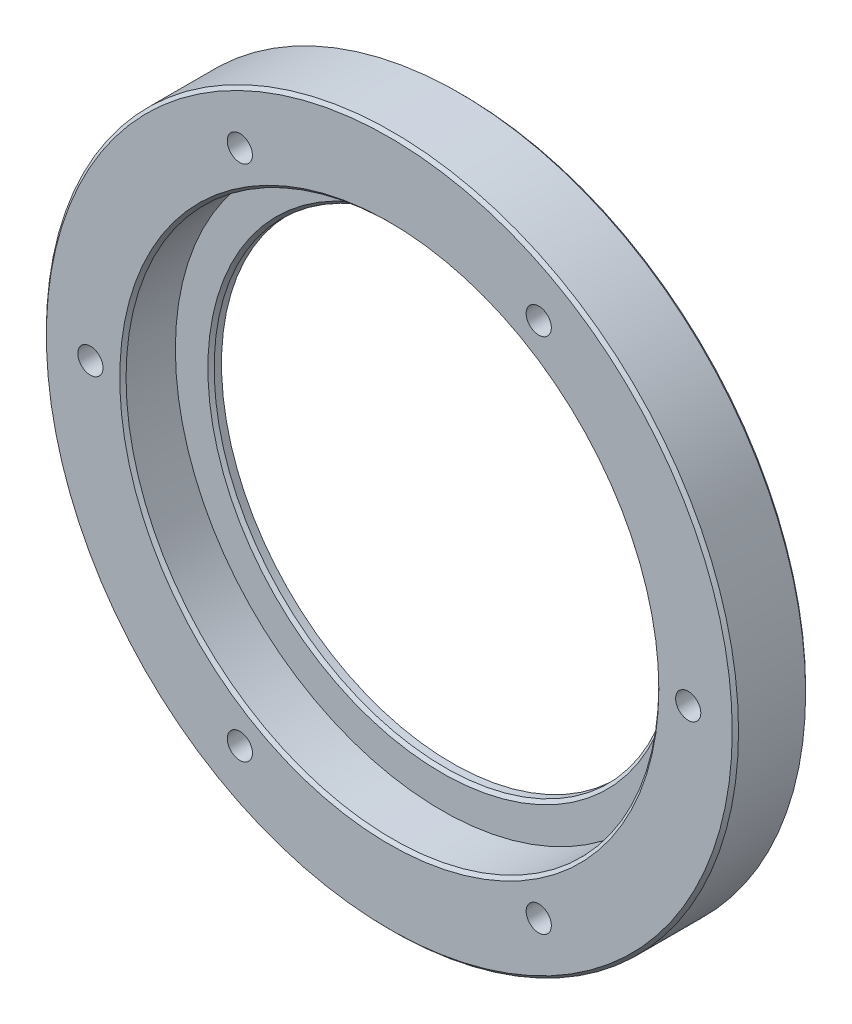
ISO-10303-21;
HEADER;
FILE_DESCRIPTION(('STEP AP214'),'2;1');
FILE_NAME('part.step','',(''),(''),'','','');
FILE_SCHEMA(('AUTOMOTIVE_DESIGN { 1 0 10303 214 1 1 1 1 }'));
ENDSEC;
DATA;
#1=APPLICATION_CONTEXT('core data for automotive mechanical design processes');
#2=APPLICATION_PROTOCOL_DEFINITION('international standard','automotive_design',2000,#1);
#3=PRODUCT_CONTEXT('',#1,'mechanical');
#4=PRODUCT('Part','Part','',(#3));
#5=PRODUCT_RELATED_PRODUCT_CATEGORY('part','',(#4));
#6=PRODUCT_DEFINITION_FORMATION('','',#4);
#7=PRODUCT_DEFINITION_CONTEXT('part definition',#1,'design');
#8=PRODUCT_DEFINITION('design','',#6,#7);
#9=PRODUCT_DEFINITION_SHAPE('','',#8);
#10=(LENGTH_UNIT() NAMED_UNIT(*) SI_UNIT(.MILLI.,.METRE.));
#11=(NAMED_UNIT(*) PLANE_ANGLE_UNIT() SI_UNIT($,.RADIAN.));
#12=(NAMED_UNIT(*) SI_UNIT($,.STERADIAN.) SOLID_ANGLE_UNIT());
#13=UNCERTAINTY_MEASURE_WITH_UNIT(LENGTH_MEASURE(1.E-05),#10,'distance_accuracy_value','');
#14=(GEOMETRIC_REPRESENTATION_CONTEXT(3) GLOBAL_UNCERTAINTY_ASSIGNED_CONTEXT((#13)) GLOBAL_UNIT_ASSIGNED_CONTEXT((#10,
#11,#12)) REPRESENTATION_CONTEXT('',''));
#15=CARTESIAN_POINT('',(0.,0.,0.));
#16=DIRECTION('',(0.,0.,1.));
#17=DIRECTION('',(1.,0.,0.));
#18=AXIS2_PLACEMENT_3D('',#15,#16,#17);
#19=CARTESIAN_POINT('',(-28.5,3.00107161343988E-13,7.));
#20=DIRECTION('',(0.,0.,-1.));
#21=DIRECTION('',(-1.,0.,0.));
#22=AXIS2_PLACEMENT_3D('',#19,#20,#21);
#23=CYLINDRICAL_SURFACE('',#22,1.2);
#24=CARTESIAN_POINT('',(-28.5,3.00107161343988E-13,7.));
#25=DIRECTION('',(0.,0.,-1.));
#26=DIRECTION('',(-0.50000000000001,-0.866025403784433,0.));
#27=AXIS2_PLACEMENT_3D('',#24,#25,#26);
#28=CIRCLE('',#27,1.2);
#29=CARTESIAN_POINT('',(-29.1,-1.03923048454102,7.));
#30=VERTEX_POINT('',#29);
#31=EDGE_CURVE('E93',#30,#30,#28,.T.);
#32=ORIENTED_EDGE('',*,*,#31,.F.);
#33=EDGE_LOOP('',(#32));
#34=FACE_BOUND('',#33,.T.);
#35=CARTESIAN_POINT('',(-28.5,3.00107161343988E-13,2.));
#36=DIRECTION('',(0.,0.,-1.));
#37=DIRECTION('',(-1.,0.,0.));
#38=AXIS2_PLACEMENT_3D('',#35,#36,#37);
#39=CIRCLE('',#38,1.2);
#40=CARTESIAN_POINT('',(-29.7,3.00107161343988E-13,2.));
#41=VERTEX_POINT('',#40);
#42=EDGE_CURVE('E89',#41,#41,#39,.F.);
#43=ORIENTED_EDGE('',*,*,#42,.F.);
#44=EDGE_LOOP('',(#43));
#45=FACE_BOUND('',#44,.T.);
#46=ADVANCED_FACE('F37',(#34,#45),#23,.F.);
#47=CARTESIAN_POINT('',(-14.2500000000002,-24.6817240078564,7.));
#48=DIRECTION('',(0.,0.,-1.));
#49=DIRECTION('',(-1.,0.,0.));
#50=AXIS2_PLACEMENT_3D('',#47,#48,#49);
#51=CYLINDRICAL_SURFACE('',#50,1.2);
#52=CARTESIAN_POINT('',(-14.2500000000002,-24.6817240078564,7.));
#53=DIRECTION('',(0.,0.,-1.));
#54=DIRECTION('',(0.499999999999992,-0.866025403784443,0.));
#55=AXIS2_PLACEMENT_3D('',#52,#53,#54);
#56=CIRCLE('',#55,1.2);
#57=CARTESIAN_POINT('',(-13.6500000000002,-25.7209544923977,7.));
#58=VERTEX_POINT('',#57);
#59=EDGE_CURVE('E134',#58,#58,#56,.T.);
#60=ORIENTED_EDGE('',*,*,#59,.F.);
#61=EDGE_LOOP('',(#60));
#62=FACE_BOUND('',#61,.T.);
#63=CARTESIAN_POINT('',(-14.2500000000002,-24.6817240078564,2.));
#64=DIRECTION('',(0.,0.,-1.));
#65=DIRECTION('',(-1.,0.,0.));
#66=AXIS2_PLACEMENT_3D('',#63,#64,#65);
#67=CIRCLE('',#66,1.2);
#68=CARTESIAN_POINT('',(-15.4500000000002,-24.6817240078564,2.));
#69=VERTEX_POINT('',#68);
#70=EDGE_CURVE('E94',#69,#69,#67,.F.);
#71=ORIENTED_EDGE('',*,*,#70,.F.);
#72=EDGE_LOOP('',(#71));
#73=FACE_BOUND('',#72,.T.);
#74=ADVANCED_FACE('F232',(#62,#73),#51,.F.);
#75=CARTESIAN_POINT('',(14.25,-24.6817240078565,7.));
#76=DIRECTION('',(0.,0.,-1.));
#77=DIRECTION('',(-1.,0.,0.));
#78=AXIS2_PLACEMENT_3D('',#75,#76,#77);
#79=CYLINDRICAL_SURFACE('',#78,1.2);
#80=CARTESIAN_POINT('',(14.25,-24.6817240078565,7.));
#81=DIRECTION('',(0.,0.,-1.));
#82=DIRECTION('',(1.,0.,0.));
#83=AXIS2_PLACEMENT_3D('',#80,#81,#82);
#84=CIRCLE('',#83,1.2);
#85=CARTESIAN_POINT('',(15.45,-24.6817240078565,7.));
#86=VERTEX_POINT('',#85);
#87=EDGE_CURVE('E138',#86,#86,#84,.T.);
#88=ORIENTED_EDGE('',*,*,#87,.F.);
#89=EDGE_LOOP('',(#88));
#90=FACE_BOUND('',#89,.T.);
#91=CARTESIAN_POINT('',(14.25,-24.6817240078565,2.));
#92=DIRECTION('',(0.,0.,-1.));
#93=DIRECTION('',(-1.,0.,0.));
#94=AXIS2_PLACEMENT_3D('',#91,#92,#93);
#95=CIRCLE('',#94,1.2);
#96=CARTESIAN_POINT('',(13.05,-24.6817240078565,2.));
#97=VERTEX_POINT('',#96);
#98=EDGE_CURVE('E98',#97,#97,#95,.F.);
#99=ORIENTED_EDGE('',*,*,#98,.F.);
#100=EDGE_LOOP('',(#99));
#101=FACE_BOUND('',#100,.T.);
#102=ADVANCED_FACE('F238',(#90,#101),#79,.F.);
#103=CARTESIAN_POINT('',(28.5,0.,7.));
#104=DIRECTION('',(0.,0.,-1.));
#105=DIRECTION('',(-1.,0.,0.));
#106=AXIS2_PLACEMENT_3D('',#103,#104,#105);
#107=CYLINDRICAL_SURFACE('',#106,1.2);
#108=CARTESIAN_POINT('',(28.5,0.,7.));
#109=DIRECTION('',(0.,0.,-1.));
#110=DIRECTION('',(0.500000000000004,0.866025403784436,0.));
#111=AXIS2_PLACEMENT_3D('',#108,#109,#110);
#112=CIRCLE('',#111,1.2);
#113=CARTESIAN_POINT('',(29.1,1.03923048454123,7.));
#114=VERTEX_POINT('',#113);
#115=EDGE_CURVE('E142',#114,#114,#112,.T.);
#116=ORIENTED_EDGE('',*,*,#115,.F.);
#117=EDGE_LOOP('',(#116));
#118=FACE_BOUND('',#117,.T.);
#119=CARTESIAN_POINT('',(28.5,0.,2.));
#120=DIRECTION('',(0.,0.,-1.));
#121=DIRECTION('',(-1.,0.,0.));
#122=AXIS2_PLACEMENT_3D('',#119,#120,#121);
#123=CIRCLE('',#122,1.2);
#124=CARTESIAN_POINT('',(27.3,0.,2.));
#125=VERTEX_POINT('',#124);
#126=EDGE_CURVE('E102',#125,#125,#123,.F.);
#127=ORIENTED_EDGE('',*,*,#126,.F.);
#128=EDGE_LOOP('',(#127));
#129=FACE_BOUND('',#128,.T.);
#130=ADVANCED_FACE('F246',(#118,#129),#107,.F.);
#131=CARTESIAN_POINT('',(14.25,24.6817240078565,7.));
#132=DIRECTION('',(0.,0.,-1.));
#133=DIRECTION('',(-1.,0.,0.));
#134=AXIS2_PLACEMENT_3D('',#131,#132,#133);
#135=CYLINDRICAL_SURFACE('',#134,1.2);
#136=CARTESIAN_POINT('',(14.25,24.6817240078565,7.));
#137=DIRECTION('',(0.,0.,-1.));
#138=DIRECTION('',(-0.499999999999998,0.86602540378444,0.));
#139=AXIS2_PLACEMENT_3D('',#136,#137,#138);
#140=CIRCLE('',#139,1.2);
#141=CARTESIAN_POINT('',(13.65,25.7209544923978,7.));
#142=VERTEX_POINT('',#141);
#143=EDGE_CURVE('E127',#142,#142,#140,.T.);
#144=ORIENTED_EDGE('',*,*,#143,.F.);
#145=EDGE_LOOP('',(#144));
#146=FACE_BOUND('',#145,.T.);
#147=CARTESIAN_POINT('',(14.25,24.6817240078565,2.));
#148=DIRECTION('',(0.,0.,-1.));
#149=DIRECTION('',(-1.,0.,0.));
#150=AXIS2_PLACEMENT_3D('',#147,#148,#149);
#151=CIRCLE('',#150,1.2);
#152=CARTESIAN_POINT('',(13.05,24.6817240078565,2.));
#153=VERTEX_POINT('',#152);
#154=EDGE_CURVE('E106',#153,#153,#151,.F.);
#155=ORIENTED_EDGE('',*,*,#154,.F.);
#156=EDGE_LOOP('',(#155));
#157=FACE_BOUND('',#156,.T.);
#158=ADVANCED_FACE('F250',(#146,#157),#135,.F.);
#159=CARTESIAN_POINT('',(-14.25,24.6817240078565,7.));
#160=DIRECTION('',(0.,0.,-1.));
#161=DIRECTION('',(-1.,0.,0.));
#162=AXIS2_PLACEMENT_3D('',#159,#160,#161);
#163=CYLINDRICAL_SURFACE('',#162,1.2);
#164=CARTESIAN_POINT('',(-14.25,24.6817240078565,7.));
#165=DIRECTION('',(0.,0.,-1.));
#166=DIRECTION('',(-1.,0.,0.));
#167=AXIS2_PLACEMENT_3D('',#164,#165,#166);
#168=CIRCLE('',#167,1.2);
#169=CARTESIAN_POINT('',(-15.45,24.6817240078565,7.));
#170=VERTEX_POINT('',#169);
#171=EDGE_CURVE('E115',#170,#170,#168,.T.);
#172=ORIENTED_EDGE('',*,*,#171,.F.);
#173=EDGE_LOOP('',(#172));
#174=FACE_BOUND('',#173,.T.);
#175=CARTESIAN_POINT('',(-14.25,24.6817240078565,2.));
#176=DIRECTION('',(0.,0.,-1.));
#177=DIRECTION('',(-1.,0.,0.));
#178=AXIS2_PLACEMENT_3D('',#175,#176,#177);
#179=CIRCLE('',#178,1.2);
#180=CARTESIAN_POINT('',(-15.45,24.6817240078565,2.));
#181=VERTEX_POINT('',#180);
#182=EDGE_CURVE('E111',#181,#181,#179,.F.);
#183=ORIENTED_EDGE('',*,*,#182,.F.);
#184=EDGE_LOOP('',(#183));
#185=FACE_BOUND('',#184,.T.);
#186=ADVANCED_FACE('F254',(#174,#185),#163,.F.);
#187=CARTESIAN_POINT('',(0.,0.,0.));
#188=DIRECTION('',(0.,0.,1.));
#189=DIRECTION('',(1.,0.,0.));
#190=AXIS2_PLACEMENT_3D('',#187,#188,#189);
#191=CYLINDRICAL_SURFACE('',#190,22.);
#192=CARTESIAN_POINT('',(0.,0.,1.70000000000001));
#193=DIRECTION('',(0.,0.,1.));
#194=DIRECTION('',(1.,0.,0.));
#195=AXIS2_PLACEMENT_3D('',#192,#193,#194);
#196=CIRCLE('',#195,22.);
#197=CARTESIAN_POINT('',(22.,0.,1.70000000000001));
#198=VERTEX_POINT('',#197);
#199=EDGE_CURVE('E72',#198,#198,#196,.T.);
#200=ORIENTED_EDGE('',*,*,#199,.T.);
#201=EDGE_LOOP('',(#200));
#202=FACE_BOUND('',#201,.T.);
#203=CARTESIAN_POINT('',(0.,0.,0.999999999999997));
#204=DIRECTION('',(0.,0.,1.));
#205=DIRECTION('',(1.,0.,0.));
#206=AXIS2_PLACEMENT_3D('',#203,#204,#205);
#207=CIRCLE('',#206,22.);
#208=CARTESIAN_POINT('',(22.,0.,0.999999999999997));
#209=VERTEX_POINT('',#208);
#210=EDGE_CURVE('E80',#209,#209,#207,.F.);
#211=ORIENTED_EDGE('',*,*,#210,.T.);
#212=EDGE_LOOP('',(#211));
#213=FACE_BOUND('',#212,.T.);
#214=ADVANCED_FACE('F426',(#202,#213),#191,.F.);
#215=CARTESIAN_POINT('',(0.,0.,7.));
#216=DIRECTION('',(0.,0.,-1.));
#217=DIRECTION('',(-1.,0.,0.));
#218=AXIS2_PLACEMENT_3D('',#215,#216,#217);
#219=CYLINDRICAL_SURFACE('',#218,33.);
#220=CARTESIAN_POINT('',(0.,0.,0.300000000000022));
#221=DIRECTION('',(0.,0.,1.));
#222=DIRECTION('',(1.,0.,0.));
#223=AXIS2_PLACEMENT_3D('',#220,#221,#222);
#224=CIRCLE('',#223,33.);
#225=CARTESIAN_POINT('',(33.,0.,0.300000000000022));
#226=VERTEX_POINT('',#225);
#227=EDGE_CURVE('E46',#226,#226,#224,.T.);
#228=ORIENTED_EDGE('',*,*,#227,.T.);
#229=EDGE_LOOP('',(#228));
#230=FACE_BOUND('',#229,.T.);
#231=CARTESIAN_POINT('',(0.,0.,6.69999999999999));
#232=DIRECTION('',(0.,0.,1.));
#233=DIRECTION('',(1.,0.,0.));
#234=AXIS2_PLACEMENT_3D('',#231,#232,#233);
#235=CIRCLE('',#234,33.);
#236=CARTESIAN_POINT('',(33.,0.,6.69999999999999));
#237=VERTEX_POINT('',#236);
#238=EDGE_CURVE('E52',#237,#237,#235,.F.);
#239=ORIENTED_EDGE('',*,*,#238,.T.);
#240=EDGE_LOOP('',(#239));
#241=FACE_BOUND('',#240,.T.);
#242=ADVANCED_FACE('F415',(#230,#241),#219,.T.);
#243=CARTESIAN_POINT('',(0.,0.,7.));
#244=DIRECTION('',(0.,0.,1.));
#245=DIRECTION('',(1.,0.,0.));
#246=AXIS2_PLACEMENT_3D('',#243,#244,#245);
#247=PLANE('',#246);
#248=CARTESIAN_POINT('',(0.,0.,7.));
#249=DIRECTION('',(0.,0.,1.));
#250=DIRECTION('',(1.,0.,0.));
#251=AXIS2_PLACEMENT_3D('',#248,#249,#250);
#252=CIRCLE('',#251,25.7);
#253=CARTESIAN_POINT('',(25.7,0.,7.));
#254=VERTEX_POINT('',#253);
#255=EDGE_CURVE('E58',#254,#254,#252,.F.);
#256=ORIENTED_EDGE('',*,*,#255,.T.);
#257=EDGE_LOOP('',(#256));
#258=FACE_BOUND('',#257,.T.);
#259=CARTESIAN_POINT('',(0.,0.,7.));
#260=DIRECTION('',(0.,0.,1.));
#261=DIRECTION('',(1.,0.,0.));
#262=AXIS2_PLACEMENT_3D('',#259,#260,#261);
#263=CIRCLE('',#262,32.7);
#264=CARTESIAN_POINT('',(32.7,0.,7.));
#265=VERTEX_POINT('',#264);
#266=EDGE_CURVE('E64',#265,#265,#263,.T.);
#267=ORIENTED_EDGE('',*,*,#266,.T.);
#268=EDGE_LOOP('',(#267));
#269=FACE_BOUND('',#268,.T.);
#270=ORIENTED_EDGE('',*,*,#143,.T.);
#271=EDGE_LOOP('',(#270));
#272=FACE_BOUND('',#271,.T.);
#273=ORIENTED_EDGE('',*,*,#115,.T.);
#274=EDGE_LOOP('',(#273));
#275=FACE_BOUND('',#274,.T.);
#276=ORIENTED_EDGE('',*,*,#87,.T.);
#277=EDGE_LOOP('',(#276));
#278=FACE_BOUND('',#277,.T.);
#279=ORIENTED_EDGE('',*,*,#59,.T.);
#280=EDGE_LOOP('',(#279));
#281=FACE_BOUND('',#280,.T.);
#282=ORIENTED_EDGE('',*,*,#31,.T.);
#283=EDGE_LOOP('',(#282));
#284=FACE_BOUND('',#283,.T.);
#285=ORIENTED_EDGE('',*,*,#171,.T.);
#286=EDGE_LOOP('',(#285));
#287=FACE_BOUND('',#286,.T.);
#288=ADVANCED_FACE('F204',(#258,#269,#272,#275,#278,#281,#284,#287),#247,.T.);
#289=CARTESIAN_POINT('',(0.,0.,0.));
#290=DIRECTION('',(0.,0.,1.));
#291=DIRECTION('',(1.,0.,0.));
#292=AXIS2_PLACEMENT_3D('',#289,#290,#291);
#293=PLANE('',#292);
#294=CARTESIAN_POINT('',(0.,0.,0.));
#295=DIRECTION('',(0.,0.,1.));
#296=DIRECTION('',(1.,0.,0.));
#297=AXIS2_PLACEMENT_3D('',#294,#295,#296);
#298=CIRCLE('',#297,32.7);
#299=CARTESIAN_POINT('',(32.7,0.,0.));
#300=VERTEX_POINT('',#299);
#301=EDGE_CURVE('E10',#300,#300,#298,.F.);
#302=ORIENTED_EDGE('',*,*,#301,.T.);
#303=EDGE_LOOP('',(#302));
#304=FACE_BOUND('',#303,.T.);
#305=CARTESIAN_POINT('',(0.,0.,0.));
#306=DIRECTION('',(0.,0.,1.));
#307=DIRECTION('',(1.,0.,0.));
#308=AXIS2_PLACEMENT_3D('',#305,#306,#307);
#309=CIRCLE('',#308,24.);
#310=CARTESIAN_POINT('',(24.,0.,0.));
#311=VERTEX_POINT('',#310);
#312=EDGE_CURVE('E84',#311,#311,#309,.T.);
#313=ORIENTED_EDGE('',*,*,#312,.T.);
#314=EDGE_LOOP('',(#313));
#315=FACE_BOUND('',#314,.T.);
#316=CARTESIAN_POINT('',(14.25,24.6817240078565,0.));
#317=DIRECTION('',(0.,0.,-1.));
#318=DIRECTION('',(-0.499999999999998,0.86602540378444,0.));
#319=AXIS2_PLACEMENT_3D('',#316,#317,#318);
#320=CIRCLE('',#319,2.1);
#321=CARTESIAN_POINT('',(13.2,26.5003773558038,0.));
#322=VERTEX_POINT('',#321);
#323=EDGE_CURVE('E181',#322,#322,#320,.T.);
#324=ORIENTED_EDGE('',*,*,#323,.F.);
#325=EDGE_LOOP('',(#324));
#326=FACE_BOUND('',#325,.T.);
#327=CARTESIAN_POINT('',(28.5,0.,0.));
#328=DIRECTION('',(0.,0.,-1.));
#329=DIRECTION('',(0.500000000000004,0.866025403784436,0.));
#330=AXIS2_PLACEMENT_3D('',#327,#328,#329);
#331=CIRCLE('',#330,2.1);
#332=CARTESIAN_POINT('',(29.55,1.81865334794722,0.));
#333=VERTEX_POINT('',#332);
#334=EDGE_CURVE('E173',#333,#333,#331,.T.);
#335=ORIENTED_EDGE('',*,*,#334,.F.);
#336=EDGE_LOOP('',(#335));
#337=FACE_BOUND('',#336,.T.);
#338=CARTESIAN_POINT('',(14.25,-24.6817240078565,0.));
#339=DIRECTION('',(0.,0.,-1.));
#340=DIRECTION('',(1.,0.,0.));
#341=AXIS2_PLACEMENT_3D('',#338,#339,#340);
#342=CIRCLE('',#341,2.1);
#343=CARTESIAN_POINT('',(16.35,-24.6817240078565,0.));
#344=VERTEX_POINT('',#343);
#345=EDGE_CURVE('E165',#344,#344,#342,.T.);
#346=ORIENTED_EDGE('',*,*,#345,.F.);
#347=EDGE_LOOP('',(#346));
#348=FACE_BOUND('',#347,.T.);
#349=CARTESIAN_POINT('',(-14.2500000000002,-24.6817240078564,0.));
#350=DIRECTION('',(0.,0.,-1.));
#351=DIRECTION('',(0.499999999999992,-0.866025403784443,0.));
#352=AXIS2_PLACEMENT_3D('',#349,#350,#351);
#353=CIRCLE('',#352,2.1);
#354=CARTESIAN_POINT('',(-13.2000000000002,-26.5003773558037,0.));
#355=VERTEX_POINT('',#354);
#356=EDGE_CURVE('E157',#355,#355,#353,.T.);
#357=ORIENTED_EDGE('',*,*,#356,.F.);
#358=EDGE_LOOP('',(#357));
#359=FACE_BOUND('',#358,.T.);
#360=CARTESIAN_POINT('',(-28.5,3.00107161343988E-13,0.));
#361=DIRECTION('',(0.,0.,-1.));
#362=DIRECTION('',(-0.50000000000001,-0.866025403784433,0.));
#363=AXIS2_PLACEMENT_3D('',#360,#361,#362);
#364=CIRCLE('',#363,2.1);
#365=CARTESIAN_POINT('',(-29.55,-1.81865334794701,0.));
#366=VERTEX_POINT('',#365);
#367=EDGE_CURVE('E149',#366,#366,#364,.T.);
#368=ORIENTED_EDGE('',*,*,#367,.F.);
#369=EDGE_LOOP('',(#368));
#370=FACE_BOUND('',#369,.T.);
#371=CARTESIAN_POINT('',(-14.25,24.6817240078565,0.));
#372=DIRECTION('',(0.,0.,-1.));
#373=DIRECTION('',(-1.,0.,0.));
#374=AXIS2_PLACEMENT_3D('',#371,#372,#373);
#375=CIRCLE('',#374,2.1);
#376=CARTESIAN_POINT('',(-16.35,24.6817240078565,0.));
#377=VERTEX_POINT('',#376);
#378=EDGE_CURVE('E123',#377,#377,#375,.T.);
#379=ORIENTED_EDGE('',*,*,#378,.F.);
#380=EDGE_LOOP('',(#379));
#381=FACE_BOUND('',#380,.T.);
#382=ADVANCED_FACE('F200',(#304,#315,#326,#337,#348,#359,#370,#381),#293,.F.);
#383=CARTESIAN_POINT('',(0.,0.,2.));
#384=DIRECTION('',(0.,0.,1.));
#385=DIRECTION('',(1.,0.,0.));
#386=AXIS2_PLACEMENT_3D('',#383,#384,#385);
#387=PLANE('',#386);
#388=CARTESIAN_POINT('',(0.,0.,2.));
#389=DIRECTION('',(0.,0.,1.));
#390=DIRECTION('',(1.,0.,0.));
#391=AXIS2_PLACEMENT_3D('',#388,#389,#390);
#392=CIRCLE('',#391,22.3);
#393=CARTESIAN_POINT('',(22.3,0.,2.));
#394=VERTEX_POINT('',#393);
#395=EDGE_CURVE('E76',#394,#394,#392,.F.);
#396=ORIENTED_EDGE('',*,*,#395,.T.);
#397=EDGE_LOOP('',(#396));
#398=FACE_BOUND('',#397,.T.);
#399=CARTESIAN_POINT('',(0.,0.,2.));
#400=DIRECTION('',(0.,0.,1.));
#401=DIRECTION('',(1.,0.,0.));
#402=AXIS2_PLACEMENT_3D('',#399,#400,#401);
#403=CIRCLE('',#402,25.4);
#404=CARTESIAN_POINT('',(25.4,0.,2.));
#405=VERTEX_POINT('',#404);
#406=EDGE_CURVE('E88',#405,#405,#403,.T.);
#407=ORIENTED_EDGE('',*,*,#406,.T.);
#408=EDGE_LOOP('',(#407));
#409=FACE_BOUND('',#408,.T.);
#410=ADVANCED_FACE('F203',(#398,#409),#387,.T.);
#411=CARTESIAN_POINT('',(0.,0.,2.));
#412=DIRECTION('',(0.,0.,1.));
#413=DIRECTION('',(1.,0.,0.));
#414=AXIS2_PLACEMENT_3D('',#411,#412,#413);
#415=CYLINDRICAL_SURFACE('',#414,25.4);
#416=CARTESIAN_POINT('',(0.,0.,6.69999999999998));
#417=DIRECTION('',(0.,0.,1.));
#418=DIRECTION('',(1.,0.,0.));
#419=AXIS2_PLACEMENT_3D('',#416,#417,#418);
#420=CIRCLE('',#419,25.4);
#421=CARTESIAN_POINT('',(25.4,0.,6.69999999999998));
#422=VERTEX_POINT('',#421);
#423=EDGE_CURVE('E68',#422,#422,#420,.T.);
#424=ORIENTED_EDGE('',*,*,#423,.T.);
#425=EDGE_LOOP('',(#424));
#426=FACE_BOUND('',#425,.T.);
#427=ORIENTED_EDGE('',*,*,#406,.F.);
#428=EDGE_LOOP('',(#427));
#429=FACE_BOUND('',#428,.T.);
#430=ADVANCED_FACE('F226',(#426,#429),#415,.F.);
#431=CARTESIAN_POINT('',(-14.25,24.6817240078565,2.));
#432=DIRECTION('',(0.,0.,-1.));
#433=DIRECTION('',(-1.,0.,0.));
#434=AXIS2_PLACEMENT_3D('',#431,#432,#433);
#435=PLANE('',#434);
#436=CARTESIAN_POINT('',(-14.25,24.6817240078565,2.));
#437=DIRECTION('',(0.,0.,-1.));
#438=DIRECTION('',(-1.,0.,0.));
#439=AXIS2_PLACEMENT_3D('',#436,#437,#438);
#440=CIRCLE('',#439,2.1);
#441=CARTESIAN_POINT('',(-16.35,24.6817240078565,2.));
#442=VERTEX_POINT('',#441);
#443=EDGE_CURVE('E116',#442,#442,#440,.T.);
#444=ORIENTED_EDGE('',*,*,#443,.T.);
#445=EDGE_LOOP('',(#444));
#446=FACE_BOUND('',#445,.T.);
#447=ORIENTED_EDGE('',*,*,#182,.T.);
#448=EDGE_LOOP('',(#447));
#449=FACE_BOUND('',#448,.T.);
#450=ADVANCED_FACE('F218',(#446,#449),#435,.T.);
#451=CARTESIAN_POINT('',(-14.25,24.6817240078565,2.));
#452=DIRECTION('',(0.,0.,-1.));
#453=DIRECTION('',(-1.,0.,0.));
#454=AXIS2_PLACEMENT_3D('',#451,#452,#453);
#455=CYLINDRICAL_SURFACE('',#454,2.1);
#456=ORIENTED_EDGE('',*,*,#443,.F.);
#457=EDGE_LOOP('',(#456));
#458=FACE_BOUND('',#457,.T.);
#459=ORIENTED_EDGE('',*,*,#378,.T.);
#460=EDGE_LOOP('',(#459));
#461=FACE_BOUND('',#460,.T.);
#462=ADVANCED_FACE('F216',(#458,#461),#455,.F.);
#463=CARTESIAN_POINT('',(14.25,24.6817240078565,2.));
#464=DIRECTION('',(0.,0.,-1.));
#465=DIRECTION('',(-0.499999999999998,0.86602540378444,0.));
#466=AXIS2_PLACEMENT_3D('',#463,#464,#465);
#467=PLANE('',#466);
#468=CARTESIAN_POINT('',(14.25,24.6817240078565,2.));
#469=DIRECTION('',(0.,0.,-1.));
#470=DIRECTION('',(-0.499999999999998,0.86602540378444,0.));
#471=AXIS2_PLACEMENT_3D('',#468,#469,#470);
#472=CIRCLE('',#471,2.1);
#473=CARTESIAN_POINT('',(13.2,26.5003773558038,2.));
#474=VERTEX_POINT('',#473);
#475=EDGE_CURVE('E110',#474,#474,#472,.T.);
#476=ORIENTED_EDGE('',*,*,#475,.T.);
#477=EDGE_LOOP('',(#476));
#478=FACE_BOUND('',#477,.T.);
#479=ORIENTED_EDGE('',*,*,#154,.T.);
#480=EDGE_LOOP('',(#479));
#481=FACE_BOUND('',#480,.T.);
#482=ADVANCED_FACE('F190',(#478,#481),#467,.T.);
#483=CARTESIAN_POINT('',(14.25,24.6817240078565,2.));
#484=DIRECTION('',(0.,0.,-1.));
#485=DIRECTION('',(-1.,0.,0.));
#486=AXIS2_PLACEMENT_3D('',#483,#484,#485);
#487=CYLINDRICAL_SURFACE('',#486,2.1);
#488=ORIENTED_EDGE('',*,*,#475,.F.);
#489=EDGE_LOOP('',(#488));
#490=FACE_BOUND('',#489,.T.);
#491=ORIENTED_EDGE('',*,*,#323,.T.);
#492=EDGE_LOOP('',(#491));
#493=FACE_BOUND('',#492,.T.);
#494=ADVANCED_FACE('F193',(#490,#493),#487,.F.);
#495=CARTESIAN_POINT('',(28.5,0.,2.));
#496=DIRECTION('',(0.,0.,-1.));
#497=DIRECTION('',(0.500000000000004,0.866025403784436,0.));
#498=AXIS2_PLACEMENT_3D('',#495,#496,#497);
#499=PLANE('',#498);
#500=CARTESIAN_POINT('',(28.5,0.,2.));
#501=DIRECTION('',(0.,0.,-1.));
#502=DIRECTION('',(0.500000000000004,0.866025403784436,0.));
#503=AXIS2_PLACEMENT_3D('',#500,#501,#502);
#504=CIRCLE('',#503,2.1);
#505=CARTESIAN_POINT('',(29.55,1.81865334794722,2.));
#506=VERTEX_POINT('',#505);
#507=EDGE_CURVE('E177',#506,#506,#504,.T.);
#508=ORIENTED_EDGE('',*,*,#507,.T.);
#509=EDGE_LOOP('',(#508));
#510=FACE_BOUND('',#509,.T.);
#511=ORIENTED_EDGE('',*,*,#126,.T.);
#512=EDGE_LOOP('',(#511));
#513=FACE_BOUND('',#512,.T.);
#514=ADVANCED_FACE('F196',(#510,#513),#499,.T.);
#515=CARTESIAN_POINT('',(28.5,0.,2.));
#516=DIRECTION('',(0.,0.,-1.));
#517=DIRECTION('',(-1.,0.,0.));
#518=AXIS2_PLACEMENT_3D('',#515,#516,#517);
#519=CYLINDRICAL_SURFACE('',#518,2.1);
#520=ORIENTED_EDGE('',*,*,#507,.F.);
#521=EDGE_LOOP('',(#520));
#522=FACE_BOUND('',#521,.T.);
#523=ORIENTED_EDGE('',*,*,#334,.T.);
#524=EDGE_LOOP('',(#523));
#525=FACE_BOUND('',#524,.T.);
#526=ADVANCED_FACE('F280',(#522,#525),#519,.F.);
#527=CARTESIAN_POINT('',(14.25,-24.6817240078565,2.));
#528=DIRECTION('',(0.,0.,-1.));
#529=DIRECTION('',(1.,0.,0.));
#530=AXIS2_PLACEMENT_3D('',#527,#528,#529);
#531=PLANE('',#530);
#532=CARTESIAN_POINT('',(14.25,-24.6817240078565,2.));
#533=DIRECTION('',(0.,0.,-1.));
#534=DIRECTION('',(1.,0.,0.));
#535=AXIS2_PLACEMENT_3D('',#532,#533,#534);
#536=CIRCLE('',#535,2.1);
#537=CARTESIAN_POINT('',(16.35,-24.6817240078565,2.));
#538=VERTEX_POINT('',#537);
#539=EDGE_CURVE('E169',#538,#538,#536,.T.);
#540=ORIENTED_EDGE('',*,*,#539,.T.);
#541=EDGE_LOOP('',(#540));
#542=FACE_BOUND('',#541,.T.);
#543=ORIENTED_EDGE('',*,*,#98,.T.);
#544=EDGE_LOOP('',(#543));
#545=FACE_BOUND('',#544,.T.);
#546=ADVANCED_FACE('F276',(#542,#545),#531,.T.);
#547=CARTESIAN_POINT('',(14.25,-24.6817240078565,2.));
#548=DIRECTION('',(0.,0.,-1.));
#549=DIRECTION('',(-1.,0.,0.));
#550=AXIS2_PLACEMENT_3D('',#547,#548,#549);
#551=CYLINDRICAL_SURFACE('',#550,2.1);
#552=ORIENTED_EDGE('',*,*,#539,.F.);
#553=EDGE_LOOP('',(#552));
#554=FACE_BOUND('',#553,.T.);
#555=ORIENTED_EDGE('',*,*,#345,.T.);
#556=EDGE_LOOP('',(#555));
#557=FACE_BOUND('',#556,.T.);
#558=ADVANCED_FACE('F272',(#554,#557),#551,.F.);
#559=CARTESIAN_POINT('',(-14.2500000000002,-24.6817240078564,2.));
#560=DIRECTION('',(0.,0.,-1.));
#561=DIRECTION('',(0.499999999999992,-0.866025403784443,0.));
#562=AXIS2_PLACEMENT_3D('',#559,#560,#561);
#563=PLANE('',#562);
#564=CARTESIAN_POINT('',(-14.2500000000002,-24.6817240078564,2.));
#565=DIRECTION('',(0.,0.,-1.));
#566=DIRECTION('',(0.499999999999992,-0.866025403784443,0.));
#567=AXIS2_PLACEMENT_3D('',#564,#565,#566);
#568=CIRCLE('',#567,2.1);
#569=CARTESIAN_POINT('',(-13.2000000000002,-26.5003773558037,2.));
#570=VERTEX_POINT('',#569);
#571=EDGE_CURVE('E161',#570,#570,#568,.T.);
#572=ORIENTED_EDGE('',*,*,#571,.T.);
#573=EDGE_LOOP('',(#572));
#574=FACE_BOUND('',#573,.T.);
#575=ORIENTED_EDGE('',*,*,#70,.T.);
#576=EDGE_LOOP('',(#575));
#577=FACE_BOUND('',#576,.T.);
#578=ADVANCED_FACE('F268',(#574,#577),#563,.T.);
#579=CARTESIAN_POINT('',(-14.2500000000002,-24.6817240078564,2.));
#580=DIRECTION('',(0.,0.,-1.));
#581=DIRECTION('',(-1.,0.,0.));
#582=AXIS2_PLACEMENT_3D('',#579,#580,#581);
#583=CYLINDRICAL_SURFACE('',#582,2.1);
#584=ORIENTED_EDGE('',*,*,#571,.F.);
#585=EDGE_LOOP('',(#584));
#586=FACE_BOUND('',#585,.T.);
#587=ORIENTED_EDGE('',*,*,#356,.T.);
#588=EDGE_LOOP('',(#587));
#589=FACE_BOUND('',#588,.T.);
#590=ADVANCED_FACE('F264',(#586,#589),#583,.F.);
#591=CARTESIAN_POINT('',(-28.5,3.00107161343988E-13,2.));
#592=DIRECTION('',(0.,0.,-1.));
#593=DIRECTION('',(-0.50000000000001,-0.866025403784433,0.));
#594=AXIS2_PLACEMENT_3D('',#591,#592,#593);
#595=PLANE('',#594);
#596=CARTESIAN_POINT('',(-28.5,3.00107161343988E-13,2.));
#597=DIRECTION('',(0.,0.,-1.));
#598=DIRECTION('',(-0.50000000000001,-0.866025403784433,0.));
#599=AXIS2_PLACEMENT_3D('',#596,#597,#598);
#600=CIRCLE('',#599,2.1);
#601=CARTESIAN_POINT('',(-29.55,-1.81865334794701,2.));
#602=VERTEX_POINT('',#601);
#603=EDGE_CURVE('E153',#602,#602,#600,.T.);
#604=ORIENTED_EDGE('',*,*,#603,.T.);
#605=EDGE_LOOP('',(#604));
#606=FACE_BOUND('',#605,.T.);
#607=ORIENTED_EDGE('',*,*,#42,.T.);
#608=EDGE_LOOP('',(#607));
#609=FACE_BOUND('',#608,.T.);
#610=ADVANCED_FACE('F260',(#606,#609),#595,.T.);
#611=CARTESIAN_POINT('',(-28.5,3.00107161343988E-13,2.));
#612=DIRECTION('',(0.,0.,-1.));
#613=DIRECTION('',(-1.,0.,0.));
#614=AXIS2_PLACEMENT_3D('',#611,#612,#613);
#615=CYLINDRICAL_SURFACE('',#614,2.1);
#616=ORIENTED_EDGE('',*,*,#603,.F.);
#617=EDGE_LOOP('',(#616));
#618=FACE_BOUND('',#617,.T.);
#619=ORIENTED_EDGE('',*,*,#367,.T.);
#620=EDGE_LOOP('',(#619));
#621=FACE_BOUND('',#620,.T.);
#622=ADVANCED_FACE('F256',(#618,#621),#615,.F.);
#623=CARTESIAN_POINT('',(0.,0.,0.));
#624=DIRECTION('',(0.,0.,-1.));
#625=DIRECTION('',(-1.,0.,0.));
#626=AXIS2_PLACEMENT_3D('',#623,#624,#625);
#627=CONICAL_SURFACE('',#626,24.,1.10714871779409);
#628=ORIENTED_EDGE('',*,*,#210,.F.);
#629=EDGE_LOOP('',(#628));
#630=FACE_BOUND('',#629,.T.);
#631=ORIENTED_EDGE('',*,*,#312,.F.);
#632=EDGE_LOOP('',(#631));
#633=FACE_BOUND('',#632,.T.);
#634=ADVANCED_FACE('F259',(#630,#633),#627,.F.);
#635=CARTESIAN_POINT('',(0.,0.,2.));
#636=DIRECTION('',(0.,0.,1.));
#637=DIRECTION('',(1.,0.,0.));
#638=AXIS2_PLACEMENT_3D('',#635,#636,#637);
#639=CONICAL_SURFACE('',#638,22.3,0.78539816339746);
#640=ORIENTED_EDGE('',*,*,#199,.F.);
#641=EDGE_LOOP('',(#640));
#642=FACE_BOUND('',#641,.T.);
#643=ORIENTED_EDGE('',*,*,#395,.F.);
#644=EDGE_LOOP('',(#643));
#645=FACE_BOUND('',#644,.T.);
#646=ADVANCED_FACE('F330',(#642,#645),#639,.F.);
#647=CARTESIAN_POINT('',(0.,0.,6.69999999999998));
#648=DIRECTION('',(0.,0.,1.));
#649=DIRECTION('',(1.,0.,0.));
#650=AXIS2_PLACEMENT_3D('',#647,#648,#649);
#651=CONICAL_SURFACE('',#650,25.4,0.785398163397448);
#652=ORIENTED_EDGE('',*,*,#255,.F.);
#653=EDGE_LOOP('',(#652));
#654=FACE_BOUND('',#653,.T.);
#655=ORIENTED_EDGE('',*,*,#423,.F.);
#656=EDGE_LOOP('',(#655));
#657=FACE_BOUND('',#656,.T.);
#658=ADVANCED_FACE('F338',(#654,#657),#651,.F.);
#659=CARTESIAN_POINT('',(0.,0.,0.300000000000022));
#660=DIRECTION('',(0.,0.,1.));
#661=DIRECTION('',(1.,0.,0.));
#662=AXIS2_PLACEMENT_3D('',#659,#660,#661);
#663=CONICAL_SURFACE('',#662,33.,0.785398163397425);
#664=ORIENTED_EDGE('',*,*,#301,.F.);
#665=EDGE_LOOP('',(#664));
#666=FACE_BOUND('',#665,.T.);
#667=ORIENTED_EDGE('',*,*,#227,.F.);
#668=EDGE_LOOP('',(#667));
#669=FACE_BOUND('',#668,.T.);
#670=ADVANCED_FACE('F346',(#666,#669),#663,.T.);
#671=CARTESIAN_POINT('',(0.,0.,7.));
#672=DIRECTION('',(0.,0.,-1.));
#673=DIRECTION('',(-1.,0.,0.));
#674=AXIS2_PLACEMENT_3D('',#671,#672,#673);
#675=CONICAL_SURFACE('',#674,32.7,0.785398163397425);
#676=ORIENTED_EDGE('',*,*,#238,.F.);
#677=EDGE_LOOP('',(#676));
#678=FACE_BOUND('',#677,.T.);
#679=ORIENTED_EDGE('',*,*,#266,.F.);
#680=EDGE_LOOP('',(#679));
#681=FACE_BOUND('',#680,.T.);
#682=ADVANCED_FACE('F40',(#678,#681),#675,.T.);
#683=CLOSED_SHELL('',(#46,#74,#102,#130,#158,#186,#214,#242,#288,#382,#410,#430,#450,#462,#482,
#494,#514,#526,#546,#558,#578,#590,#610,#622,#634,#646,#658,#670,#682));
#684=MANIFOLD_SOLID_BREP('B2',#683);
#685=ADVANCED_BREP_SHAPE_REPRESENTATION('',(#18,#684),#14);
#686=SHAPE_DEFINITION_REPRESENTATION(#9,#685);
ENDSEC;
END-ISO-10303-21;
